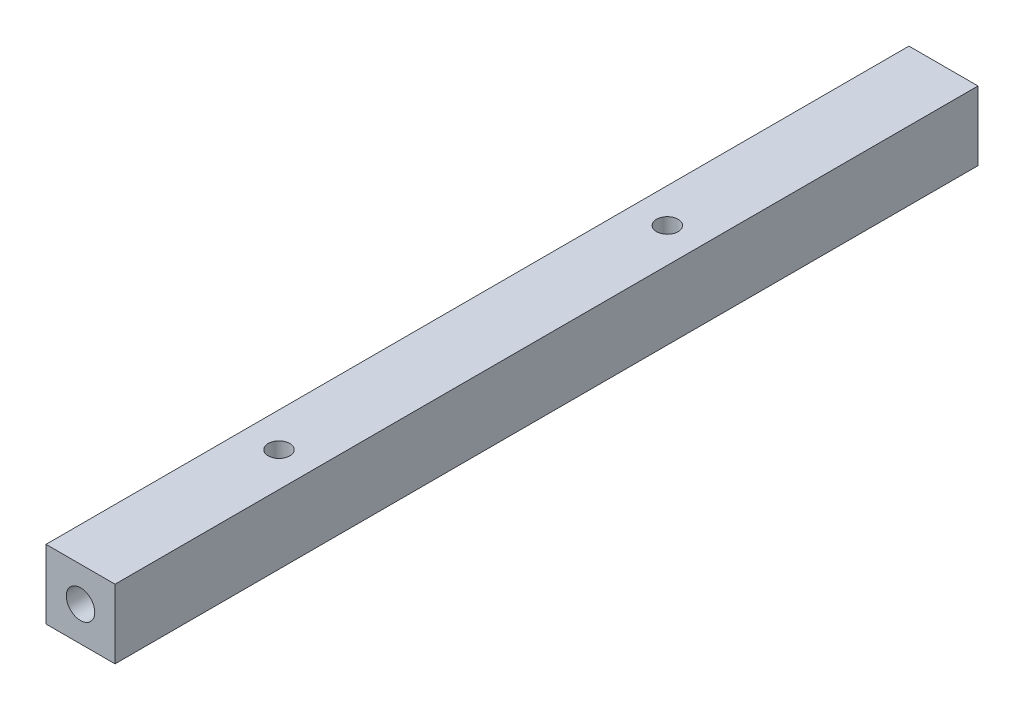
ISO-10303-21;
HEADER;
FILE_DESCRIPTION(('STEP AP214'),'2;1');
FILE_NAME('part.step','',(''),(''),'','','');
FILE_SCHEMA(('AUTOMOTIVE_DESIGN { 1 0 10303 214 1 1 1 1 }'));
ENDSEC;
DATA;
#1=APPLICATION_CONTEXT('core data for automotive mechanical design processes');
#2=APPLICATION_PROTOCOL_DEFINITION('international standard','automotive_design',2000,#1);
#3=PRODUCT_CONTEXT('',#1,'mechanical');
#4=PRODUCT('Part','Part','',(#3));
#5=PRODUCT_RELATED_PRODUCT_CATEGORY('part','',(#4));
#6=PRODUCT_DEFINITION_FORMATION('','',#4);
#7=PRODUCT_DEFINITION_CONTEXT('part definition',#1,'design');
#8=PRODUCT_DEFINITION('design','',#6,#7);
#9=PRODUCT_DEFINITION_SHAPE('','',#8);
#10=(LENGTH_UNIT() NAMED_UNIT(*) SI_UNIT(.MILLI.,.METRE.));
#11=(NAMED_UNIT(*) PLANE_ANGLE_UNIT() SI_UNIT($,.RADIAN.));
#12=(NAMED_UNIT(*) SI_UNIT($,.STERADIAN.) SOLID_ANGLE_UNIT());
#13=UNCERTAINTY_MEASURE_WITH_UNIT(LENGTH_MEASURE(1.E-05),#10,'distance_accuracy_value','');
#14=(GEOMETRIC_REPRESENTATION_CONTEXT(3) GLOBAL_UNCERTAINTY_ASSIGNED_CONTEXT((#13)) GLOBAL_UNIT_ASSIGNED_CONTEXT((#10,
#11,#12)) REPRESENTATION_CONTEXT('',''));
#15=CARTESIAN_POINT('',(0.,0.,0.));
#16=DIRECTION('',(0.,0.,1.));
#17=DIRECTION('',(1.,0.,0.));
#18=AXIS2_PLACEMENT_3D('',#15,#16,#17);
#19=CARTESIAN_POINT('',(0.,0.,100.));
#20=DIRECTION('',(1.,0.,0.));
#21=DIRECTION('',(0.,0.,-1.));
#22=AXIS2_PLACEMENT_3D('',#19,#20,#21);
#23=PLANE('',#22);
#24=DIRECTION('',(0.,-1.,0.));
#25=VECTOR('',#24,1.);
#26=CARTESIAN_POINT('',(0.,0.,0.));
#27=LINE('',#26,#25);
#28=CARTESIAN_POINT('',(0.,8.,0.));
#29=VERTEX_POINT('',#28);
#30=CARTESIAN_POINT('',(0.,0.,0.));
#31=VERTEX_POINT('',#30);
#32=EDGE_CURVE('E109',#29,#31,#27,.T.);
#33=ORIENTED_EDGE('',*,*,#32,.T.);
#34=DIRECTION('',(0.,0.,-1.));
#35=VECTOR('',#34,1.);
#36=CARTESIAN_POINT('',(0.,0.,100.));
#37=LINE('',#36,#35);
#38=CARTESIAN_POINT('',(0.,0.,100.));
#39=VERTEX_POINT('',#38);
#40=EDGE_CURVE('E11',#39,#31,#37,.T.);
#41=ORIENTED_EDGE('',*,*,#40,.F.);
#42=DIRECTION('',(0.,-1.,0.));
#43=VECTOR('',#42,1.);
#44=CARTESIAN_POINT('',(0.,0.,100.));
#45=LINE('',#44,#43);
#46=CARTESIAN_POINT('',(0.,8.,100.));
#47=VERTEX_POINT('',#46);
#48=EDGE_CURVE('E118',#47,#39,#45,.T.);
#49=ORIENTED_EDGE('',*,*,#48,.F.);
#50=DIRECTION('',(0.,0.,-1.));
#51=VECTOR('',#50,1.);
#52=CARTESIAN_POINT('',(0.,8.,100.));
#53=LINE('',#52,#51);
#54=EDGE_CURVE('E124',#47,#29,#53,.T.);
#55=ORIENTED_EDGE('',*,*,#54,.T.);
#56=EDGE_LOOP('',(#33,#41,#49,#55));
#57=FACE_BOUND('',#56,.T.);
#58=ADVANCED_FACE('F33',(#57),#23,.F.);
#59=CARTESIAN_POINT('',(0.,0.,100.));
#60=DIRECTION('',(0.,1.,0.));
#61=DIRECTION('',(0.,0.,1.));
#62=AXIS2_PLACEMENT_3D('',#59,#60,#61);
#63=PLANE('',#62);
#64=CARTESIAN_POINT('',(4.,0.,77.));
#65=DIRECTION('',(0.,1.,0.));
#66=DIRECTION('',(0.,0.,1.));
#67=AXIS2_PLACEMENT_3D('',#64,#65,#66);
#68=CIRCLE('',#67,1.25);
#69=CARTESIAN_POINT('',(4.,0.,78.25));
#70=VERTEX_POINT('',#69);
#71=EDGE_CURVE('E97',#70,#70,#68,.T.);
#72=ORIENTED_EDGE('',*,*,#71,.T.);
#73=EDGE_LOOP('',(#72));
#74=FACE_BOUND('',#73,.T.);
#75=CARTESIAN_POINT('',(4.,0.,32.));
#76=DIRECTION('',(0.,1.,0.));
#77=DIRECTION('',(0.,0.,1.));
#78=AXIS2_PLACEMENT_3D('',#75,#76,#77);
#79=CIRCLE('',#78,1.25);
#80=CARTESIAN_POINT('',(4.,0.,33.25));
#81=VERTEX_POINT('',#80);
#82=EDGE_CURVE('E103',#81,#81,#79,.T.);
#83=ORIENTED_EDGE('',*,*,#82,.T.);
#84=EDGE_LOOP('',(#83));
#85=FACE_BOUND('',#84,.T.);
#86=DIRECTION('',(1.,0.,0.));
#87=VECTOR('',#86,1.);
#88=CARTESIAN_POINT('',(0.,0.,0.));
#89=LINE('',#88,#87);
#90=CARTESIAN_POINT('',(8.,0.,0.));
#91=VERTEX_POINT('',#90);
#92=EDGE_CURVE('E112',#31,#91,#89,.T.);
#93=ORIENTED_EDGE('',*,*,#92,.T.);
#94=DIRECTION('',(0.,0.,-1.));
#95=VECTOR('',#94,1.);
#96=CARTESIAN_POINT('',(8.,0.,100.));
#97=LINE('',#96,#95);
#98=CARTESIAN_POINT('',(8.,0.,100.));
#99=VERTEX_POINT('',#98);
#100=EDGE_CURVE('E40',#99,#91,#97,.T.);
#101=ORIENTED_EDGE('',*,*,#100,.F.);
#102=DIRECTION('',(1.,0.,0.));
#103=VECTOR('',#102,1.);
#104=CARTESIAN_POINT('',(0.,0.,100.));
#105=LINE('',#104,#103);
#106=EDGE_CURVE('E120',#39,#99,#105,.T.);
#107=ORIENTED_EDGE('',*,*,#106,.F.);
#108=ORIENTED_EDGE('',*,*,#40,.T.);
#109=EDGE_LOOP('',(#93,#101,#107,#108));
#110=FACE_BOUND('',#109,.T.);
#111=ADVANCED_FACE('F145',(#74,#85,#110),#63,.F.);
#112=CARTESIAN_POINT('',(8.,0.,100.));
#113=DIRECTION('',(-1.,0.,0.));
#114=DIRECTION('',(0.,0.,1.));
#115=AXIS2_PLACEMENT_3D('',#112,#113,#114);
#116=PLANE('',#115);
#117=DIRECTION('',(0.,1.,0.));
#118=VECTOR('',#117,1.);
#119=CARTESIAN_POINT('',(8.,0.,0.));
#120=LINE('',#119,#118);
#121=CARTESIAN_POINT('',(8.,8.,0.));
#122=VERTEX_POINT('',#121);
#123=EDGE_CURVE('E114',#91,#122,#120,.T.);
#124=ORIENTED_EDGE('',*,*,#123,.T.);
#125=DIRECTION('',(0.,0.,-1.));
#126=VECTOR('',#125,1.);
#127=CARTESIAN_POINT('',(8.,8.,100.));
#128=LINE('',#127,#126);
#129=CARTESIAN_POINT('',(8.,8.,100.));
#130=VERTEX_POINT('',#129);
#131=EDGE_CURVE('E127',#130,#122,#128,.T.);
#132=ORIENTED_EDGE('',*,*,#131,.F.);
#133=DIRECTION('',(0.,1.,0.));
#134=VECTOR('',#133,1.);
#135=CARTESIAN_POINT('',(8.,0.,100.));
#136=LINE('',#135,#134);
#137=EDGE_CURVE('E52',#99,#130,#136,.T.);
#138=ORIENTED_EDGE('',*,*,#137,.F.);
#139=ORIENTED_EDGE('',*,*,#100,.T.);
#140=EDGE_LOOP('',(#124,#132,#138,#139));
#141=FACE_BOUND('',#140,.T.);
#142=ADVANCED_FACE('F133',(#141),#116,.F.);
#143=CARTESIAN_POINT('',(0.,8.,100.));
#144=DIRECTION('',(0.,-1.,0.));
#145=DIRECTION('',(0.,0.,-1.));
#146=AXIS2_PLACEMENT_3D('',#143,#144,#145);
#147=PLANE('',#146);
#148=CARTESIAN_POINT('',(4.,8.,77.));
#149=DIRECTION('',(0.,1.,0.));
#150=DIRECTION('',(0.,0.,1.));
#151=AXIS2_PLACEMENT_3D('',#148,#149,#150);
#152=CIRCLE('',#151,1.24999999999999);
#153=CARTESIAN_POINT('',(4.,8.,78.25));
#154=VERTEX_POINT('',#153);
#155=EDGE_CURVE('E100',#154,#154,#152,.T.);
#156=ORIENTED_EDGE('',*,*,#155,.F.);
#157=EDGE_LOOP('',(#156));
#158=FACE_BOUND('',#157,.T.);
#159=CARTESIAN_POINT('',(4.,8.,32.));
#160=DIRECTION('',(0.,1.,0.));
#161=DIRECTION('',(0.,0.,1.));
#162=AXIS2_PLACEMENT_3D('',#159,#160,#161);
#163=CIRCLE('',#162,1.24999999999999);
#164=CARTESIAN_POINT('',(4.,8.,33.25));
#165=VERTEX_POINT('',#164);
#166=EDGE_CURVE('E106',#165,#165,#163,.T.);
#167=ORIENTED_EDGE('',*,*,#166,.F.);
#168=EDGE_LOOP('',(#167));
#169=FACE_BOUND('',#168,.T.);
#170=DIRECTION('',(-1.,0.,0.));
#171=VECTOR('',#170,1.);
#172=CARTESIAN_POINT('',(0.,8.,0.));
#173=LINE('',#172,#171);
#174=EDGE_CURVE('E116',#122,#29,#173,.T.);
#175=ORIENTED_EDGE('',*,*,#174,.T.);
#176=ORIENTED_EDGE('',*,*,#54,.F.);
#177=DIRECTION('',(-1.,0.,0.));
#178=VECTOR('',#177,1.);
#179=CARTESIAN_POINT('',(0.,8.,100.));
#180=LINE('',#179,#178);
#181=EDGE_CURVE('E47',#130,#47,#180,.T.);
#182=ORIENTED_EDGE('',*,*,#181,.F.);
#183=ORIENTED_EDGE('',*,*,#131,.T.);
#184=EDGE_LOOP('',(#175,#176,#182,#183));
#185=FACE_BOUND('',#184,.T.);
#186=ADVANCED_FACE('F140',(#158,#169,#185),#147,.F.);
#187=CARTESIAN_POINT('',(0.,8.,100.));
#188=DIRECTION('',(0.,0.,-1.));
#189=DIRECTION('',(-1.,0.,0.));
#190=AXIS2_PLACEMENT_3D('',#187,#188,#189);
#191=PLANE('',#190);
#192=CARTESIAN_POINT('',(4.,4.,100.));
#193=DIRECTION('',(0.,0.,1.));
#194=DIRECTION('',(1.,0.,0.));
#195=AXIS2_PLACEMENT_3D('',#192,#193,#194);
#196=CIRCLE('',#195,1.64999999999999);
#197=CARTESIAN_POINT('',(5.64999999999999,4.,100.));
#198=VERTEX_POINT('',#197);
#199=EDGE_CURVE('E94',#198,#198,#196,.T.);
#200=ORIENTED_EDGE('',*,*,#199,.F.);
#201=EDGE_LOOP('',(#200));
#202=FACE_BOUND('',#201,.T.);
#203=ORIENTED_EDGE('',*,*,#48,.T.);
#204=ORIENTED_EDGE('',*,*,#106,.T.);
#205=ORIENTED_EDGE('',*,*,#137,.T.);
#206=ORIENTED_EDGE('',*,*,#181,.T.);
#207=EDGE_LOOP('',(#203,#204,#205,#206));
#208=FACE_BOUND('',#207,.T.);
#209=ADVANCED_FACE('F144',(#202,#208),#191,.F.);
#210=CARTESIAN_POINT('',(0.,8.,0.));
#211=DIRECTION('',(0.,0.,-1.));
#212=DIRECTION('',(-1.,0.,0.));
#213=AXIS2_PLACEMENT_3D('',#210,#211,#212);
#214=PLANE('',#213);
#215=CARTESIAN_POINT('',(4.,4.,0.));
#216=DIRECTION('',(0.,0.,-1.));
#217=DIRECTION('',(-1.,0.,0.));
#218=AXIS2_PLACEMENT_3D('',#215,#216,#217);
#219=CIRCLE('',#218,1.64999999999999);
#220=CARTESIAN_POINT('',(2.35000000000001,4.,0.));
#221=VERTEX_POINT('',#220);
#222=EDGE_CURVE('E86',#221,#221,#219,.T.);
#223=ORIENTED_EDGE('',*,*,#222,.F.);
#224=EDGE_LOOP('',(#223));
#225=FACE_BOUND('',#224,.T.);
#226=ORIENTED_EDGE('',*,*,#32,.F.);
#227=ORIENTED_EDGE('',*,*,#174,.F.);
#228=ORIENTED_EDGE('',*,*,#123,.F.);
#229=ORIENTED_EDGE('',*,*,#92,.F.);
#230=EDGE_LOOP('',(#226,#227,#228,#229));
#231=FACE_BOUND('',#230,.T.);
#232=ADVANCED_FACE('F138',(#225,#231),#214,.T.);
#233=CARTESIAN_POINT('',(4.,8.,32.));
#234=DIRECTION('',(0.,1.,0.));
#235=DIRECTION('',(0.,0.,1.));
#236=AXIS2_PLACEMENT_3D('',#233,#234,#235);
#237=CYLINDRICAL_SURFACE('',#236,1.24999999999999);
#238=ORIENTED_EDGE('',*,*,#82,.F.);
#239=EDGE_LOOP('',(#238));
#240=FACE_BOUND('',#239,.T.);
#241=ORIENTED_EDGE('',*,*,#166,.T.);
#242=EDGE_LOOP('',(#241));
#243=FACE_BOUND('',#242,.T.);
#244=ADVANCED_FACE('F163',(#240,#243),#237,.F.);
#245=CARTESIAN_POINT('',(4.,8.,77.));
#246=DIRECTION('',(0.,1.,0.));
#247=DIRECTION('',(0.,0.,1.));
#248=AXIS2_PLACEMENT_3D('',#245,#246,#247);
#249=CYLINDRICAL_SURFACE('',#248,1.24999999999999);
#250=ORIENTED_EDGE('',*,*,#71,.F.);
#251=EDGE_LOOP('',(#250));
#252=FACE_BOUND('',#251,.T.);
#253=ORIENTED_EDGE('',*,*,#155,.T.);
#254=EDGE_LOOP('',(#253));
#255=FACE_BOUND('',#254,.T.);
#256=ADVANCED_FACE('F167',(#252,#255),#249,.F.);
#257=CARTESIAN_POINT('',(4.,4.,100.));
#258=DIRECTION('',(0.,0.,1.));
#259=DIRECTION('',(1.,0.,0.));
#260=AXIS2_PLACEMENT_3D('',#257,#258,#259);
#261=CYLINDRICAL_SURFACE('',#260,1.64999999999999);
#262=CARTESIAN_POINT('',(4.,4.,90.));
#263=DIRECTION('',(0.,0.,1.));
#264=DIRECTION('',(1.,0.,0.));
#265=AXIS2_PLACEMENT_3D('',#262,#263,#264);
#266=CIRCLE('',#265,1.65);
#267=CARTESIAN_POINT('',(5.65,4.,90.));
#268=VERTEX_POINT('',#267);
#269=EDGE_CURVE('E89',#268,#268,#266,.T.);
#270=ORIENTED_EDGE('',*,*,#269,.F.);
#271=EDGE_LOOP('',(#270));
#272=FACE_BOUND('',#271,.T.);
#273=ORIENTED_EDGE('',*,*,#199,.T.);
#274=EDGE_LOOP('',(#273));
#275=FACE_BOUND('',#274,.T.);
#276=ADVANCED_FACE('F171',(#272,#275),#261,.F.);
#277=CARTESIAN_POINT('',(4.,4.,90.));
#278=DIRECTION('',(0.,0.,1.));
#279=DIRECTION('',(1.,0.,0.));
#280=AXIS2_PLACEMENT_3D('',#277,#278,#279);
#281=CONICAL_SURFACE('',#280,1.65,1.02974425867665);
#282=CARTESIAN_POINT('',(4.,4.,89.0085799786045));
#283=VERTEX_POINT('',#282);
#284=VERTEX_LOOP('',#283);
#285=FACE_BOUND('',#284,.T.);
#286=ORIENTED_EDGE('',*,*,#269,.T.);
#287=EDGE_LOOP('',(#286));
#288=FACE_BOUND('',#287,.T.);
#289=ADVANCED_FACE('F175',(#285,#288),#281,.F.);
#290=CARTESIAN_POINT('',(4.,4.,0.));
#291=DIRECTION('',(0.,0.,-1.));
#292=DIRECTION('',(-1.,0.,0.));
#293=AXIS2_PLACEMENT_3D('',#290,#291,#292);
#294=CYLINDRICAL_SURFACE('',#293,1.64999999999999);
#295=CARTESIAN_POINT('',(4.,4.,10.));
#296=DIRECTION('',(0.,0.,-1.));
#297=DIRECTION('',(-1.,0.,0.));
#298=AXIS2_PLACEMENT_3D('',#295,#296,#297);
#299=CIRCLE('',#298,1.65);
#300=CARTESIAN_POINT('',(2.35,4.,10.));
#301=VERTEX_POINT('',#300);
#302=EDGE_CURVE('E84',#301,#301,#299,.T.);
#303=ORIENTED_EDGE('',*,*,#302,.F.);
#304=EDGE_LOOP('',(#303));
#305=FACE_BOUND('',#304,.T.);
#306=ORIENTED_EDGE('',*,*,#222,.T.);
#307=EDGE_LOOP('',(#306));
#308=FACE_BOUND('',#307,.T.);
#309=ADVANCED_FACE('F80',(#305,#308),#294,.F.);
#310=CARTESIAN_POINT('',(4.,4.,10.));
#311=DIRECTION('',(0.,0.,-1.));
#312=DIRECTION('',(-1.,0.,0.));
#313=AXIS2_PLACEMENT_3D('',#310,#311,#312);
#314=CONICAL_SURFACE('',#313,1.65,1.02974425867665);
#315=CARTESIAN_POINT('',(4.,4.,10.9914200213955));
#316=VERTEX_POINT('',#315);
#317=VERTEX_LOOP('',#316);
#318=FACE_BOUND('',#317,.T.);
#319=ORIENTED_EDGE('',*,*,#302,.T.);
#320=EDGE_LOOP('',(#319));
#321=FACE_BOUND('',#320,.T.);
#322=ADVANCED_FACE('F77',(#318,#321),#314,.F.);
#323=CLOSED_SHELL('',(#58,#111,#142,#186,#209,#232,#244,#256,#276,#289,#309,#322));
#324=MANIFOLD_SOLID_BREP('B2',#323);
#325=ADVANCED_BREP_SHAPE_REPRESENTATION('',(#18,#324),#14);
#326=SHAPE_DEFINITION_REPRESENTATION(#9,#325);
ENDSEC;
END-ISO-10303-21;
